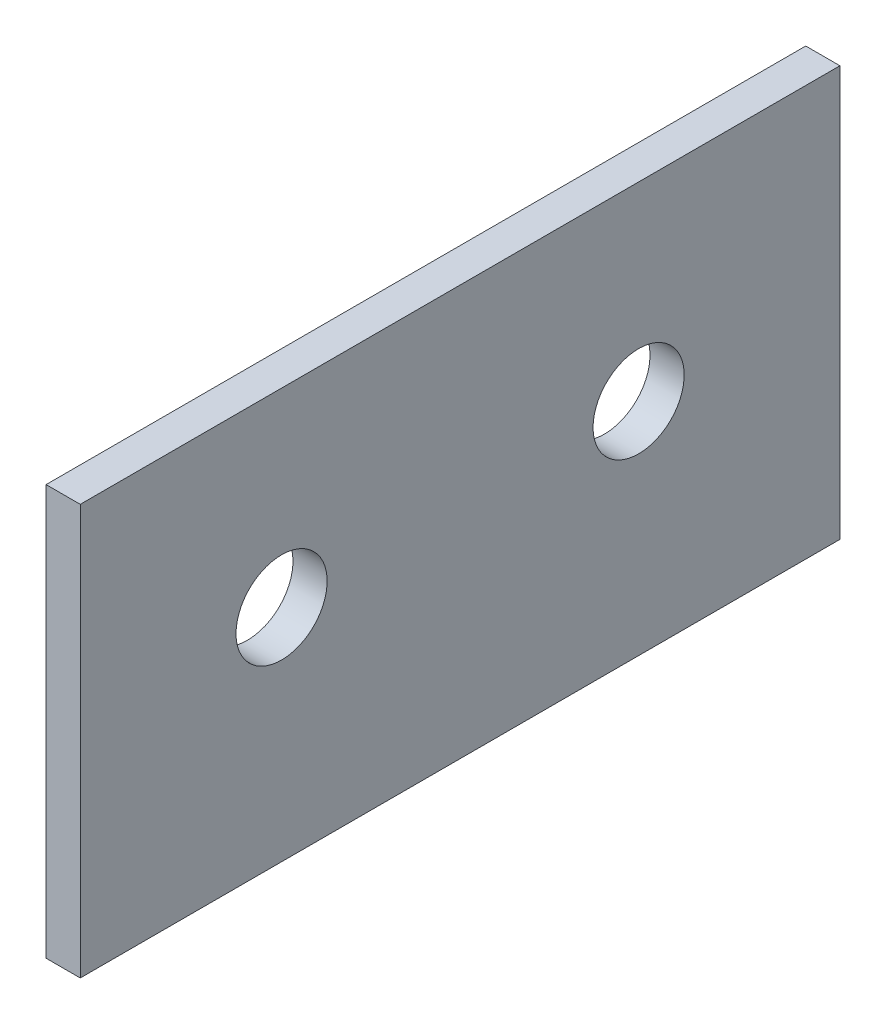
ISO-10303-21;
HEADER;
FILE_DESCRIPTION(('STEP AP214'),'2;1');
FILE_NAME('part.step','',(''),(''),'','','');
FILE_SCHEMA(('AUTOMOTIVE_DESIGN { 1 0 10303 214 1 1 1 1 }'));
ENDSEC;
DATA;
#1=APPLICATION_CONTEXT('core data for automotive mechanical design processes');
#2=APPLICATION_PROTOCOL_DEFINITION('international standard','automotive_design',2000,#1);
#3=PRODUCT_CONTEXT('',#1,'mechanical');
#4=PRODUCT('Part','Part','',(#3));
#5=PRODUCT_RELATED_PRODUCT_CATEGORY('part','',(#4));
#6=PRODUCT_DEFINITION_FORMATION('','',#4);
#7=PRODUCT_DEFINITION_CONTEXT('part definition',#1,'design');
#8=PRODUCT_DEFINITION('design','',#6,#7);
#9=PRODUCT_DEFINITION_SHAPE('','',#8);
#10=(LENGTH_UNIT() NAMED_UNIT(*) SI_UNIT(.MILLI.,.METRE.));
#11=(NAMED_UNIT(*) PLANE_ANGLE_UNIT() SI_UNIT($,.RADIAN.));
#12=(NAMED_UNIT(*) SI_UNIT($,.STERADIAN.) SOLID_ANGLE_UNIT());
#13=UNCERTAINTY_MEASURE_WITH_UNIT(LENGTH_MEASURE(1.E-05),#10,'distance_accuracy_value','');
#14=(GEOMETRIC_REPRESENTATION_CONTEXT(3) GLOBAL_UNCERTAINTY_ASSIGNED_CONTEXT((#13)) GLOBAL_UNIT_ASSIGNED_CONTEXT((#10,
#11,#12)) REPRESENTATION_CONTEXT('',''));
#15=CARTESIAN_POINT('',(0.,0.,0.));
#16=DIRECTION('',(0.,0.,1.));
#17=DIRECTION('',(1.,0.,0.));
#18=AXIS2_PLACEMENT_3D('',#15,#16,#17);
#19=CARTESIAN_POINT('',(66.4790867357422,25.412948775593,-2.56163175760841));
#20=DIRECTION('',(1.,0.,0.));
#21=DIRECTION('',(0.,0.,-1.));
#22=AXIS2_PLACEMENT_3D('',#19,#20,#21);
#23=PLANE('',#22);
#24=DIRECTION('',(0.,0.,1.));
#25=VECTOR('',#24,1.);
#26=CARTESIAN_POINT('',(66.4790867357422,25.412948775593,52.4383682423918));
#27=LINE('',#26,#25);
#28=CARTESIAN_POINT('',(66.4790867357422,25.412948775593,8.27276455739157));
#29=VERTEX_POINT('',#28);
#30=CARTESIAN_POINT('',(66.4790867357422,25.412948775593,41.6060978907249));
#31=VERTEX_POINT('',#30);
#32=EDGE_CURVE('E114',#29,#31,#27,.T.);
#33=ORIENTED_EDGE('',*,*,#32,.T.);
#34=DIRECTION('',(0.,-1.,0.));
#35=VECTOR('',#34,1.);
#36=CARTESIAN_POINT('',(66.4790867357422,25.412948775593,41.6060978907249));
#37=LINE('',#36,#35);
#38=CARTESIAN_POINT('',(66.4790867357422,7.41294877559305,41.6060978907249));
#39=VERTEX_POINT('',#38);
#40=EDGE_CURVE('E87',#31,#39,#37,.T.);
#41=ORIENTED_EDGE('',*,*,#40,.T.);
#42=DIRECTION('',(0.,0.,-1.));
#43=VECTOR('',#42,1.);
#44=CARTESIAN_POINT('',(66.4790867357422,7.41294877559305,8.27276455739157));
#45=LINE('',#44,#43);
#46=CARTESIAN_POINT('',(66.4790867357422,7.41294877559305,8.27276455739157));
#47=VERTEX_POINT('',#46);
#48=EDGE_CURVE('E96',#39,#47,#45,.T.);
#49=ORIENTED_EDGE('',*,*,#48,.T.);
#50=DIRECTION('',(0.,1.,0.));
#51=VECTOR('',#50,1.);
#52=CARTESIAN_POINT('',(66.4790867357422,25.412948775593,8.27276455739157));
#53=LINE('',#52,#51);
#54=EDGE_CURVE('E100',#47,#29,#53,.T.);
#55=ORIENTED_EDGE('',*,*,#54,.T.);
#56=EDGE_LOOP('',(#33,#41,#49,#55));
#57=FACE_BOUND('',#56,.T.);
#58=CARTESIAN_POINT('',(66.4790867357422,17.0796154422597,17.1060978907249));
#59=DIRECTION('',(-1.,0.,0.));
#60=DIRECTION('',(0.,0.,1.));
#61=AXIS2_PLACEMENT_3D('',#58,#59,#60);
#62=CIRCLE('',#61,2.);
#63=CARTESIAN_POINT('',(66.4790867357422,17.0796154422597,19.1060978907249));
#64=VERTEX_POINT('',#63);
#65=EDGE_CURVE('E103',#64,#64,#62,.T.);
#66=ORIENTED_EDGE('',*,*,#65,.T.);
#67=EDGE_LOOP('',(#66));
#68=FACE_BOUND('',#67,.T.);
#69=CARTESIAN_POINT('',(66.4790867357422,17.0796154422597,32.7727645573916));
#70=DIRECTION('',(-1.,0.,0.));
#71=DIRECTION('',(0.,0.,1.));
#72=AXIS2_PLACEMENT_3D('',#69,#70,#71);
#73=CIRCLE('',#72,2.00000000000001);
#74=CARTESIAN_POINT('',(66.4790867357422,17.0796154422597,34.7727645573916));
#75=VERTEX_POINT('',#74);
#76=EDGE_CURVE('E118',#75,#75,#73,.T.);
#77=ORIENTED_EDGE('',*,*,#76,.T.);
#78=EDGE_LOOP('',(#77));
#79=FACE_BOUND('',#78,.T.);
#80=ADVANCED_FACE('F37',(#57,#68,#79),#23,.T.);
#81=CARTESIAN_POINT('',(64.9790867357422,25.412948775593,8.27276455739157));
#82=DIRECTION('',(0.,0.,-1.));
#83=DIRECTION('',(-1.,0.,0.));
#84=AXIS2_PLACEMENT_3D('',#81,#82,#83);
#85=PLANE('',#84);
#86=ORIENTED_EDGE('',*,*,#54,.F.);
#87=DIRECTION('',(1.,0.,0.));
#88=VECTOR('',#87,1.);
#89=CARTESIAN_POINT('',(64.9790867357422,7.41294877559305,8.27276455739157));
#90=LINE('',#89,#88);
#91=CARTESIAN_POINT('',(64.9790867357422,7.41294877559305,8.27276455739157));
#92=VERTEX_POINT('',#91);
#93=EDGE_CURVE('E45',#92,#47,#90,.T.);
#94=ORIENTED_EDGE('',*,*,#93,.F.);
#95=DIRECTION('',(0.,1.,0.));
#96=VECTOR('',#95,1.);
#97=CARTESIAN_POINT('',(64.9790867357422,25.412948775593,8.27276455739157));
#98=LINE('',#97,#96);
#99=CARTESIAN_POINT('',(64.9790867357422,25.412948775593,8.27276455739157));
#100=VERTEX_POINT('',#99);
#101=EDGE_CURVE('E93',#92,#100,#98,.T.);
#102=ORIENTED_EDGE('',*,*,#101,.T.);
#103=DIRECTION('',(1.,0.,0.));
#104=VECTOR('',#103,1.);
#105=CARTESIAN_POINT('',(64.9790867357422,25.412948775593,8.27276455739157));
#106=LINE('',#105,#104);
#107=EDGE_CURVE('E70',#100,#29,#106,.T.);
#108=ORIENTED_EDGE('',*,*,#107,.T.);
#109=EDGE_LOOP('',(#86,#94,#102,#108));
#110=FACE_BOUND('',#109,.T.);
#111=ADVANCED_FACE('F108',(#110),#85,.T.);
#112=CARTESIAN_POINT('',(64.9790867357422,7.41294877559305,8.27276455739157));
#113=DIRECTION('',(0.,-1.,0.));
#114=DIRECTION('',(0.,0.,-1.));
#115=AXIS2_PLACEMENT_3D('',#112,#113,#114);
#116=PLANE('',#115);
#117=ORIENTED_EDGE('',*,*,#48,.F.);
#118=DIRECTION('',(1.,0.,0.));
#119=VECTOR('',#118,1.);
#120=CARTESIAN_POINT('',(64.9790867357422,7.41294877559305,41.6060978907249));
#121=LINE('',#120,#119);
#122=CARTESIAN_POINT('',(64.9790867357422,7.41294877559305,41.6060978907249));
#123=VERTEX_POINT('',#122);
#124=EDGE_CURVE('E63',#123,#39,#121,.T.);
#125=ORIENTED_EDGE('',*,*,#124,.F.);
#126=DIRECTION('',(0.,0.,-1.));
#127=VECTOR('',#126,1.);
#128=CARTESIAN_POINT('',(64.9790867357422,7.41294877559305,8.27276455739157));
#129=LINE('',#128,#127);
#130=EDGE_CURVE('E92',#123,#92,#129,.T.);
#131=ORIENTED_EDGE('',*,*,#130,.T.);
#132=ORIENTED_EDGE('',*,*,#93,.T.);
#133=EDGE_LOOP('',(#117,#125,#131,#132));
#134=FACE_BOUND('',#133,.T.);
#135=ADVANCED_FACE('F111',(#134),#116,.T.);
#136=CARTESIAN_POINT('',(64.9790867357422,25.412948775593,41.6060978907249));
#137=DIRECTION('',(0.,0.,1.));
#138=DIRECTION('',(1.,0.,0.));
#139=AXIS2_PLACEMENT_3D('',#136,#137,#138);
#140=PLANE('',#139);
#141=ORIENTED_EDGE('',*,*,#40,.F.);
#142=DIRECTION('',(1.,0.,0.));
#143=VECTOR('',#142,1.);
#144=CARTESIAN_POINT('',(64.9790867357422,25.412948775593,41.6060978907249));
#145=LINE('',#144,#143);
#146=CARTESIAN_POINT('',(64.9790867357422,25.412948775593,41.6060978907249));
#147=VERTEX_POINT('',#146);
#148=EDGE_CURVE('E80',#147,#31,#145,.T.);
#149=ORIENTED_EDGE('',*,*,#148,.F.);
#150=DIRECTION('',(0.,-1.,0.));
#151=VECTOR('',#150,1.);
#152=CARTESIAN_POINT('',(64.9790867357422,25.412948775593,41.6060978907249));
#153=LINE('',#152,#151);
#154=EDGE_CURVE('E85',#147,#123,#153,.T.);
#155=ORIENTED_EDGE('',*,*,#154,.T.);
#156=ORIENTED_EDGE('',*,*,#124,.T.);
#157=EDGE_LOOP('',(#141,#149,#155,#156));
#158=FACE_BOUND('',#157,.T.);
#159=ADVANCED_FACE('F84',(#158),#140,.T.);
#160=CARTESIAN_POINT('',(64.9790867357422,0.,0.));
#161=DIRECTION('',(-1.,0.,0.));
#162=DIRECTION('',(0.,0.,1.));
#163=AXIS2_PLACEMENT_3D('',#160,#161,#162);
#164=PLANE('',#163);
#165=DIRECTION('',(0.,0.,1.));
#166=VECTOR('',#165,1.);
#167=CARTESIAN_POINT('',(64.9790867357422,25.412948775593,0.));
#168=LINE('',#167,#166);
#169=EDGE_CURVE('E11',#100,#147,#168,.T.);
#170=ORIENTED_EDGE('',*,*,#169,.F.);
#171=ORIENTED_EDGE('',*,*,#101,.F.);
#172=ORIENTED_EDGE('',*,*,#130,.F.);
#173=ORIENTED_EDGE('',*,*,#154,.F.);
#174=EDGE_LOOP('',(#170,#171,#172,#173));
#175=FACE_BOUND('',#174,.T.);
#176=CARTESIAN_POINT('',(64.9790867357422,17.0796154422597,17.1060978907249));
#177=DIRECTION('',(-1.,0.,0.));
#178=DIRECTION('',(0.,0.,1.));
#179=AXIS2_PLACEMENT_3D('',#176,#177,#178);
#180=CIRCLE('',#179,2.);
#181=CARTESIAN_POINT('',(64.9790867357422,17.0796154422597,19.1060978907249));
#182=VERTEX_POINT('',#181);
#183=EDGE_CURVE('E122',#182,#182,#180,.T.);
#184=ORIENTED_EDGE('',*,*,#183,.F.);
#185=EDGE_LOOP('',(#184));
#186=FACE_BOUND('',#185,.T.);
#187=CARTESIAN_POINT('',(64.9790867357422,17.0796154422597,32.7727645573916));
#188=DIRECTION('',(-1.,0.,0.));
#189=DIRECTION('',(0.,0.,1.));
#190=AXIS2_PLACEMENT_3D('',#187,#188,#189);
#191=CIRCLE('',#190,2.00000000000001);
#192=CARTESIAN_POINT('',(64.9790867357422,17.0796154422597,34.7727645573916));
#193=VERTEX_POINT('',#192);
#194=EDGE_CURVE('E115',#193,#193,#191,.T.);
#195=ORIENTED_EDGE('',*,*,#194,.F.);
#196=EDGE_LOOP('',(#195));
#197=FACE_BOUND('',#196,.T.);
#198=ADVANCED_FACE('F89',(#175,#186,#197),#164,.T.);
#199=CARTESIAN_POINT('',(66.4790867357422,17.0796154422597,32.7727645573916));
#200=DIRECTION('',(-1.,0.,0.));
#201=DIRECTION('',(0.,0.,1.));
#202=AXIS2_PLACEMENT_3D('',#199,#200,#201);
#203=CYLINDRICAL_SURFACE('',#202,2.00000000000001);
#204=ORIENTED_EDGE('',*,*,#76,.F.);
#205=EDGE_LOOP('',(#204));
#206=FACE_BOUND('',#205,.T.);
#207=ORIENTED_EDGE('',*,*,#194,.T.);
#208=EDGE_LOOP('',(#207));
#209=FACE_BOUND('',#208,.T.);
#210=ADVANCED_FACE('F129',(#206,#209),#203,.F.);
#211=CARTESIAN_POINT('',(66.4790867357422,17.0796154422597,17.1060978907249));
#212=DIRECTION('',(-1.,0.,0.));
#213=DIRECTION('',(0.,0.,1.));
#214=AXIS2_PLACEMENT_3D('',#211,#212,#213);
#215=CYLINDRICAL_SURFACE('',#214,2.);
#216=ORIENTED_EDGE('',*,*,#65,.F.);
#217=EDGE_LOOP('',(#216));
#218=FACE_BOUND('',#217,.T.);
#219=ORIENTED_EDGE('',*,*,#183,.T.);
#220=EDGE_LOOP('',(#219));
#221=FACE_BOUND('',#220,.T.);
#222=ADVANCED_FACE('F132',(#218,#221),#215,.F.);
#223=CARTESIAN_POINT('',(66.4790867357422,25.412948775593,52.4383682423918));
#224=DIRECTION('',(0.,-1.,0.));
#225=DIRECTION('',(0.,0.,-1.));
#226=AXIS2_PLACEMENT_3D('',#223,#224,#225);
#227=PLANE('',#226);
#228=ORIENTED_EDGE('',*,*,#107,.F.);
#229=ORIENTED_EDGE('',*,*,#169,.T.);
#230=ORIENTED_EDGE('',*,*,#148,.T.);
#231=ORIENTED_EDGE('',*,*,#32,.F.);
#232=EDGE_LOOP('',(#228,#229,#230,#231));
#233=FACE_BOUND('',#232,.T.);
#234=ADVANCED_FACE('F79',(#233),#227,.F.);
#235=CLOSED_SHELL('',(#80,#111,#135,#159,#198,#210,#222,#234));
#236=MANIFOLD_SOLID_BREP('B2',#235);
#237=ADVANCED_BREP_SHAPE_REPRESENTATION('',(#18,#236),#14);
#238=SHAPE_DEFINITION_REPRESENTATION(#9,#237);
ENDSEC;
END-ISO-10303-21;
